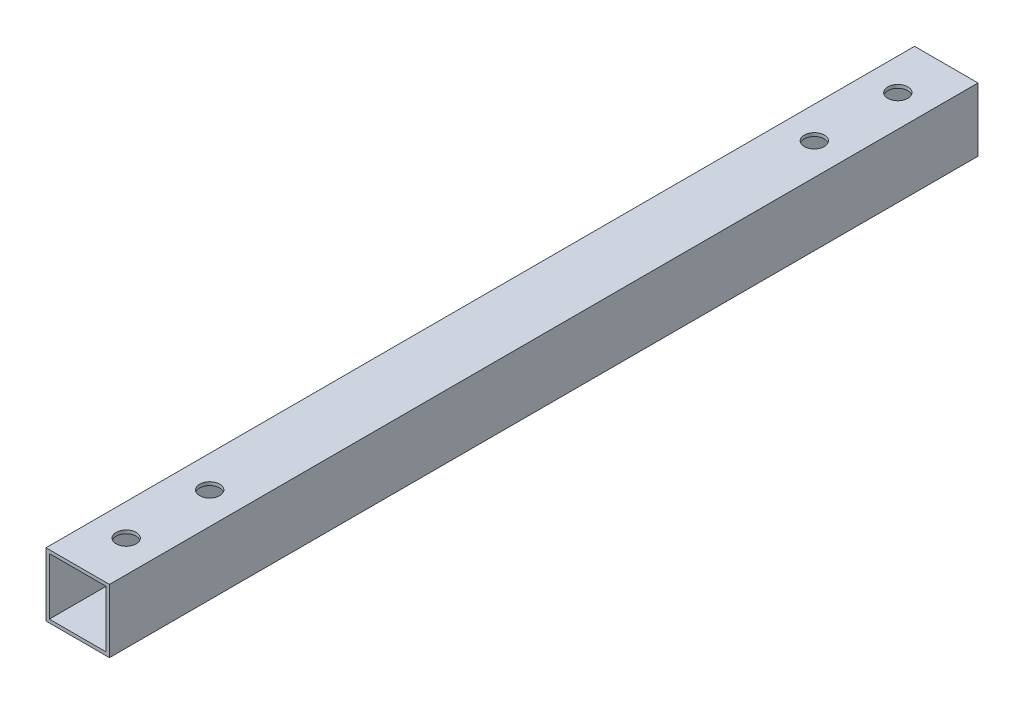
ISO-10303-21;
HEADER;
FILE_DESCRIPTION(('STEP AP214'),'2;1');
FILE_NAME('part.step','',(''),(''),'','','');
FILE_SCHEMA(('AUTOMOTIVE_DESIGN { 1 0 10303 214 1 1 1 1 }'));
ENDSEC;
DATA;
#1=APPLICATION_CONTEXT('core data for automotive mechanical design processes');
#2=APPLICATION_PROTOCOL_DEFINITION('international standard','automotive_design',2000,#1);
#3=PRODUCT_CONTEXT('',#1,'mechanical');
#4=PRODUCT('Part','Part','',(#3));
#5=PRODUCT_RELATED_PRODUCT_CATEGORY('part','',(#4));
#6=PRODUCT_DEFINITION_FORMATION('','',#4);
#7=PRODUCT_DEFINITION_CONTEXT('part definition',#1,'design');
#8=PRODUCT_DEFINITION('design','',#6,#7);
#9=PRODUCT_DEFINITION_SHAPE('','',#8);
#10=(LENGTH_UNIT() NAMED_UNIT(*) SI_UNIT(.MILLI.,.METRE.));
#11=(NAMED_UNIT(*) PLANE_ANGLE_UNIT() SI_UNIT($,.RADIAN.));
#12=(NAMED_UNIT(*) SI_UNIT($,.STERADIAN.) SOLID_ANGLE_UNIT());
#13=UNCERTAINTY_MEASURE_WITH_UNIT(LENGTH_MEASURE(1.E-05),#10,'distance_accuracy_value','');
#14=(GEOMETRIC_REPRESENTATION_CONTEXT(3) GLOBAL_UNCERTAINTY_ASSIGNED_CONTEXT((#13)) GLOBAL_UNIT_ASSIGNED_CONTEXT((#10,
#11,#12)) REPRESENTATION_CONTEXT('',''));
#15=CARTESIAN_POINT('',(0.,0.,0.));
#16=DIRECTION('',(0.,0.,1.));
#17=DIRECTION('',(1.,0.,0.));
#18=AXIS2_PLACEMENT_3D('',#15,#16,#17);
#19=CARTESIAN_POINT('',(9.5,9.5,260.));
#20=DIRECTION('',(-1.,0.,0.));
#21=DIRECTION('',(0.,0.,1.));
#22=AXIS2_PLACEMENT_3D('',#19,#20,#21);
#23=PLANE('',#22);
#24=DIRECTION('',(0.,1.,0.));
#25=VECTOR('',#24,1.);
#26=CARTESIAN_POINT('',(9.5,9.5,0.));
#27=LINE('',#26,#25);
#28=CARTESIAN_POINT('',(9.5,-9.5,0.));
#29=VERTEX_POINT('',#28);
#30=CARTESIAN_POINT('',(9.5,9.5,0.));
#31=VERTEX_POINT('',#30);
#32=EDGE_CURVE('E143',#29,#31,#27,.T.);
#33=ORIENTED_EDGE('',*,*,#32,.T.);
#34=DIRECTION('',(0.,0.,-1.));
#35=VECTOR('',#34,1.);
#36=CARTESIAN_POINT('',(9.5,9.5,260.));
#37=LINE('',#36,#35);
#38=CARTESIAN_POINT('',(9.5,9.5,260.));
#39=VERTEX_POINT('',#38);
#40=EDGE_CURVE('E11',#39,#31,#37,.T.);
#41=ORIENTED_EDGE('',*,*,#40,.F.);
#42=DIRECTION('',(0.,1.,0.));
#43=VECTOR('',#42,1.);
#44=CARTESIAN_POINT('',(9.5,9.5,260.));
#45=LINE('',#44,#43);
#46=CARTESIAN_POINT('',(9.5,-9.5,260.));
#47=VERTEX_POINT('',#46);
#48=EDGE_CURVE('E132',#47,#39,#45,.T.);
#49=ORIENTED_EDGE('',*,*,#48,.F.);
#50=DIRECTION('',(0.,0.,-1.));
#51=VECTOR('',#50,1.);
#52=CARTESIAN_POINT('',(9.5,-9.5,260.));
#53=LINE('',#52,#51);
#54=EDGE_CURVE('E142',#47,#29,#53,.T.);
#55=ORIENTED_EDGE('',*,*,#54,.T.);
#56=EDGE_LOOP('',(#33,#41,#49,#55));
#57=FACE_BOUND('',#56,.T.);
#58=ADVANCED_FACE('F32',(#57),#23,.F.);
#59=CARTESIAN_POINT('',(-9.5,9.5,260.));
#60=DIRECTION('',(0.,-1.,0.));
#61=DIRECTION('',(0.,0.,-1.));
#62=AXIS2_PLACEMENT_3D('',#59,#60,#61);
#63=PLANE('',#62);
#64=CARTESIAN_POINT('',(0.,9.5,245.5));
#65=DIRECTION('',(0.,1.,0.));
#66=DIRECTION('',(0.,0.,1.));
#67=AXIS2_PLACEMENT_3D('',#64,#65,#66);
#68=CIRCLE('',#67,2.99999999999989);
#69=CARTESIAN_POINT('',(0.,9.5,248.5));
#70=VERTEX_POINT('',#69);
#71=EDGE_CURVE('E270',#70,#70,#68,.T.);
#72=ORIENTED_EDGE('',*,*,#71,.F.);
#73=EDGE_LOOP('',(#72));
#74=FACE_BOUND('',#73,.T.);
#75=CARTESIAN_POINT('',(0.,9.5,14.5));
#76=DIRECTION('',(0.,1.,0.));
#77=DIRECTION('',(0.,0.,1.));
#78=AXIS2_PLACEMENT_3D('',#75,#76,#77);
#79=CIRCLE('',#78,2.99999999999989);
#80=CARTESIAN_POINT('',(0.,9.5,17.4999999999999));
#81=VERTEX_POINT('',#80);
#82=EDGE_CURVE('E263',#81,#81,#79,.T.);
#83=ORIENTED_EDGE('',*,*,#82,.F.);
#84=EDGE_LOOP('',(#83));
#85=FACE_BOUND('',#84,.T.);
#86=CARTESIAN_POINT('',(-1.5482407023093E-13,9.5,39.5));
#87=DIRECTION('',(0.,1.,0.));
#88=DIRECTION('',(0.,0.,1.));
#89=AXIS2_PLACEMENT_3D('',#86,#87,#88);
#90=CIRCLE('',#89,2.99999999999999);
#91=CARTESIAN_POINT('',(-1.5482407023093E-13,9.5,42.5));
#92=VERTEX_POINT('',#91);
#93=EDGE_CURVE('E275',#92,#92,#90,.T.);
#94=ORIENTED_EDGE('',*,*,#93,.F.);
#95=EDGE_LOOP('',(#94));
#96=FACE_BOUND('',#95,.T.);
#97=CARTESIAN_POINT('',(-1.5482407023093E-13,9.5,220.5));
#98=DIRECTION('',(0.,1.,0.));
#99=DIRECTION('',(0.,0.,1.));
#100=AXIS2_PLACEMENT_3D('',#97,#98,#99);
#101=CIRCLE('',#100,2.99999999999999);
#102=CARTESIAN_POINT('',(-1.5482407023093E-13,9.5,223.5));
#103=VERTEX_POINT('',#102);
#104=EDGE_CURVE('E258',#103,#103,#101,.T.);
#105=ORIENTED_EDGE('',*,*,#104,.F.);
#106=EDGE_LOOP('',(#105));
#107=FACE_BOUND('',#106,.T.);
#108=DIRECTION('',(-1.,0.,0.));
#109=VECTOR('',#108,1.);
#110=CARTESIAN_POINT('',(-9.5,9.5,0.));
#111=LINE('',#110,#109);
#112=CARTESIAN_POINT('',(-9.5,9.5,0.));
#113=VERTEX_POINT('',#112);
#114=EDGE_CURVE('E146',#31,#113,#111,.T.);
#115=ORIENTED_EDGE('',*,*,#114,.T.);
#116=DIRECTION('',(0.,0.,-1.));
#117=VECTOR('',#116,1.);
#118=CARTESIAN_POINT('',(-9.5,9.5,260.));
#119=LINE('',#118,#117);
#120=CARTESIAN_POINT('',(-9.5,9.5,260.));
#121=VERTEX_POINT('',#120);
#122=EDGE_CURVE('E40',#121,#113,#119,.T.);
#123=ORIENTED_EDGE('',*,*,#122,.F.);
#124=DIRECTION('',(-1.,0.,0.));
#125=VECTOR('',#124,1.);
#126=CARTESIAN_POINT('',(-9.5,9.5,260.));
#127=LINE('',#126,#125);
#128=EDGE_CURVE('E135',#39,#121,#127,.T.);
#129=ORIENTED_EDGE('',*,*,#128,.F.);
#130=ORIENTED_EDGE('',*,*,#40,.T.);
#131=EDGE_LOOP('',(#115,#123,#129,#130));
#132=FACE_BOUND('',#131,.T.);
#133=ADVANCED_FACE('F204',(#74,#85,#96,#107,#132),#63,.F.);
#134=CARTESIAN_POINT('',(-9.5,9.5,260.));
#135=DIRECTION('',(1.,0.,0.));
#136=DIRECTION('',(0.,1.,0.));
#137=AXIS2_PLACEMENT_3D('',#134,#135,#136);
#138=PLANE('',#137);
#139=DIRECTION('',(0.,-1.,0.));
#140=VECTOR('',#139,1.);
#141=CARTESIAN_POINT('',(-9.5,9.5,0.));
#142=LINE('',#141,#140);
#143=CARTESIAN_POINT('',(-9.5,-9.5,0.));
#144=VERTEX_POINT('',#143);
#145=EDGE_CURVE('E148',#113,#144,#142,.T.);
#146=ORIENTED_EDGE('',*,*,#145,.T.);
#147=DIRECTION('',(0.,0.,-1.));
#148=VECTOR('',#147,1.);
#149=CARTESIAN_POINT('',(-9.5,-9.5,260.));
#150=LINE('',#149,#148);
#151=CARTESIAN_POINT('',(-9.5,-9.5,260.));
#152=VERTEX_POINT('',#151);
#153=EDGE_CURVE('E153',#152,#144,#150,.T.);
#154=ORIENTED_EDGE('',*,*,#153,.F.);
#155=DIRECTION('',(0.,-1.,0.));
#156=VECTOR('',#155,1.);
#157=CARTESIAN_POINT('',(-9.5,9.5,260.));
#158=LINE('',#157,#156);
#159=EDGE_CURVE('E138',#121,#152,#158,.T.);
#160=ORIENTED_EDGE('',*,*,#159,.F.);
#161=ORIENTED_EDGE('',*,*,#122,.T.);
#162=EDGE_LOOP('',(#146,#154,#160,#161));
#163=FACE_BOUND('',#162,.T.);
#164=ADVANCED_FACE('F209',(#163),#138,.F.);
#165=CARTESIAN_POINT('',(-9.5,-9.5,260.));
#166=DIRECTION('',(0.,1.,0.));
#167=DIRECTION('',(-1.,0.,0.));
#168=AXIS2_PLACEMENT_3D('',#165,#166,#167);
#169=PLANE('',#168);
#170=CARTESIAN_POINT('',(0.,-9.5,245.5));
#171=DIRECTION('',(0.,1.,0.));
#172=DIRECTION('',(0.,0.,1.));
#173=AXIS2_PLACEMENT_3D('',#170,#171,#172);
#174=CIRCLE('',#173,2.99999999999989);
#175=CARTESIAN_POINT('',(0.,-9.5,248.5));
#176=VERTEX_POINT('',#175);
#177=EDGE_CURVE('E261',#176,#176,#174,.T.);
#178=ORIENTED_EDGE('',*,*,#177,.T.);
#179=EDGE_LOOP('',(#178));
#180=FACE_BOUND('',#179,.T.);
#181=CARTESIAN_POINT('',(0.,-9.5,14.5));
#182=DIRECTION('',(0.,1.,0.));
#183=DIRECTION('',(0.,0.,1.));
#184=AXIS2_PLACEMENT_3D('',#181,#182,#183);
#185=CIRCLE('',#184,2.99999999999989);
#186=CARTESIAN_POINT('',(0.,-9.5,17.4999999999999));
#187=VERTEX_POINT('',#186);
#188=EDGE_CURVE('E266',#187,#187,#185,.T.);
#189=ORIENTED_EDGE('',*,*,#188,.T.);
#190=EDGE_LOOP('',(#189));
#191=FACE_BOUND('',#190,.T.);
#192=CARTESIAN_POINT('',(-1.5482407023093E-13,-9.5,39.5));
#193=DIRECTION('',(0.,1.,0.));
#194=DIRECTION('',(0.,0.,1.));
#195=AXIS2_PLACEMENT_3D('',#192,#193,#194);
#196=CIRCLE('',#195,2.99999999999999);
#197=CARTESIAN_POINT('',(-1.5482407023093E-13,-9.5,42.5));
#198=VERTEX_POINT('',#197);
#199=EDGE_CURVE('E267',#198,#198,#196,.T.);
#200=ORIENTED_EDGE('',*,*,#199,.T.);
#201=EDGE_LOOP('',(#200));
#202=FACE_BOUND('',#201,.T.);
#203=CARTESIAN_POINT('',(-1.5482407023093E-13,-9.5,220.5));
#204=DIRECTION('',(0.,1.,0.));
#205=DIRECTION('',(0.,0.,1.));
#206=AXIS2_PLACEMENT_3D('',#203,#204,#205);
#207=CIRCLE('',#206,2.99999999999999);
#208=CARTESIAN_POINT('',(-1.5482407023093E-13,-9.5,223.5));
#209=VERTEX_POINT('',#208);
#210=EDGE_CURVE('E162',#209,#209,#207,.T.);
#211=ORIENTED_EDGE('',*,*,#210,.T.);
#212=EDGE_LOOP('',(#211));
#213=FACE_BOUND('',#212,.T.);
#214=DIRECTION('',(1.,0.,0.));
#215=VECTOR('',#214,1.);
#216=CARTESIAN_POINT('',(-9.5,-9.5,0.));
#217=LINE('',#216,#215);
#218=EDGE_CURVE('E136',#144,#29,#217,.T.);
#219=ORIENTED_EDGE('',*,*,#218,.T.);
#220=ORIENTED_EDGE('',*,*,#54,.F.);
#221=DIRECTION('',(1.,0.,0.));
#222=VECTOR('',#221,1.);
#223=CARTESIAN_POINT('',(-9.5,-9.5,260.));
#224=LINE('',#223,#222);
#225=EDGE_CURVE('E140',#152,#47,#224,.T.);
#226=ORIENTED_EDGE('',*,*,#225,.F.);
#227=ORIENTED_EDGE('',*,*,#153,.T.);
#228=EDGE_LOOP('',(#219,#220,#226,#227));
#229=FACE_BOUND('',#228,.T.);
#230=ADVANCED_FACE('F223',(#180,#191,#202,#213,#229),#169,.F.);
#231=CARTESIAN_POINT('',(0.,0.,260.));
#232=DIRECTION('',(0.,0.,1.));
#233=DIRECTION('',(1.,0.,0.));
#234=AXIS2_PLACEMENT_3D('',#231,#232,#233);
#235=PLANE('',#234);
#236=DIRECTION('',(0.,1.,0.));
#237=VECTOR('',#236,1.);
#238=CARTESIAN_POINT('',(8.5,9.5,260.));
#239=LINE('',#238,#237);
#240=CARTESIAN_POINT('',(8.5,-8.5,260.));
#241=VERTEX_POINT('',#240);
#242=CARTESIAN_POINT('',(8.5,8.5,260.));
#243=VERTEX_POINT('',#242);
#244=EDGE_CURVE('E120',#241,#243,#239,.T.);
#245=ORIENTED_EDGE('',*,*,#244,.F.);
#246=DIRECTION('',(1.,0.,0.));
#247=VECTOR('',#246,1.);
#248=CARTESIAN_POINT('',(-9.5,-8.5,260.));
#249=LINE('',#248,#247);
#250=CARTESIAN_POINT('',(-8.5,-8.5,260.));
#251=VERTEX_POINT('',#250);
#252=EDGE_CURVE('E103',#251,#241,#249,.T.);
#253=ORIENTED_EDGE('',*,*,#252,.F.);
#254=DIRECTION('',(0.,-1.,0.));
#255=VECTOR('',#254,1.);
#256=CARTESIAN_POINT('',(-8.5,9.5,260.));
#257=LINE('',#256,#255);
#258=CARTESIAN_POINT('',(-8.5,8.5,260.));
#259=VERTEX_POINT('',#258);
#260=EDGE_CURVE('E129',#259,#251,#257,.T.);
#261=ORIENTED_EDGE('',*,*,#260,.F.);
#262=DIRECTION('',(-1.,0.,0.));
#263=VECTOR('',#262,1.);
#264=CARTESIAN_POINT('',(-9.5,8.5,260.));
#265=LINE('',#264,#263);
#266=EDGE_CURVE('E122',#243,#259,#265,.T.);
#267=ORIENTED_EDGE('',*,*,#266,.F.);
#268=EDGE_LOOP('',(#245,#253,#261,#267));
#269=FACE_BOUND('',#268,.T.);
#270=ORIENTED_EDGE('',*,*,#48,.T.);
#271=ORIENTED_EDGE('',*,*,#128,.T.);
#272=ORIENTED_EDGE('',*,*,#159,.T.);
#273=ORIENTED_EDGE('',*,*,#225,.T.);
#274=EDGE_LOOP('',(#270,#271,#272,#273));
#275=FACE_BOUND('',#274,.T.);
#276=ADVANCED_FACE('F188',(#269,#275),#235,.T.);
#277=CARTESIAN_POINT('',(0.,0.,0.));
#278=DIRECTION('',(0.,0.,1.));
#279=DIRECTION('',(1.,0.,0.));
#280=AXIS2_PLACEMENT_3D('',#277,#278,#279);
#281=PLANE('',#280);
#282=DIRECTION('',(1.,0.,0.));
#283=VECTOR('',#282,1.);
#284=CARTESIAN_POINT('',(-9.5,-8.5,0.));
#285=LINE('',#284,#283);
#286=CARTESIAN_POINT('',(-8.5,-8.5,0.));
#287=VERTEX_POINT('',#286);
#288=CARTESIAN_POINT('',(8.5,-8.5,0.));
#289=VERTEX_POINT('',#288);
#290=EDGE_CURVE('E101',#287,#289,#285,.T.);
#291=ORIENTED_EDGE('',*,*,#290,.T.);
#292=DIRECTION('',(0.,1.,0.));
#293=VECTOR('',#292,1.);
#294=CARTESIAN_POINT('',(8.5,9.5,0.));
#295=LINE('',#294,#293);
#296=CARTESIAN_POINT('',(8.5,8.5,0.));
#297=VERTEX_POINT('',#296);
#298=EDGE_CURVE('E109',#289,#297,#295,.T.);
#299=ORIENTED_EDGE('',*,*,#298,.T.);
#300=DIRECTION('',(-1.,0.,0.));
#301=VECTOR('',#300,1.);
#302=CARTESIAN_POINT('',(-9.5,8.5,0.));
#303=LINE('',#302,#301);
#304=CARTESIAN_POINT('',(-8.5,8.5,0.));
#305=VERTEX_POINT('',#304);
#306=EDGE_CURVE('E115',#297,#305,#303,.T.);
#307=ORIENTED_EDGE('',*,*,#306,.T.);
#308=DIRECTION('',(0.,-1.,0.));
#309=VECTOR('',#308,1.);
#310=CARTESIAN_POINT('',(-8.5,9.5,0.));
#311=LINE('',#310,#309);
#312=EDGE_CURVE('E55',#305,#287,#311,.T.);
#313=ORIENTED_EDGE('',*,*,#312,.T.);
#314=EDGE_LOOP('',(#291,#299,#307,#313));
#315=FACE_BOUND('',#314,.T.);
#316=ORIENTED_EDGE('',*,*,#32,.F.);
#317=ORIENTED_EDGE('',*,*,#218,.F.);
#318=ORIENTED_EDGE('',*,*,#145,.F.);
#319=ORIENTED_EDGE('',*,*,#114,.F.);
#320=EDGE_LOOP('',(#316,#317,#318,#319));
#321=FACE_BOUND('',#320,.T.);
#322=ADVANCED_FACE('F118',(#315,#321),#281,.F.);
#323=CARTESIAN_POINT('',(8.5,9.5,260.));
#324=DIRECTION('',(-1.,0.,0.));
#325=DIRECTION('',(0.,0.,1.));
#326=AXIS2_PLACEMENT_3D('',#323,#324,#325);
#327=PLANE('',#326);
#328=ORIENTED_EDGE('',*,*,#298,.F.);
#329=DIRECTION('',(0.,0.,-1.));
#330=VECTOR('',#329,1.);
#331=CARTESIAN_POINT('',(8.5,-8.49999999999999,260.));
#332=LINE('',#331,#330);
#333=EDGE_CURVE('E97',#241,#289,#332,.T.);
#334=ORIENTED_EDGE('',*,*,#333,.F.);
#335=ORIENTED_EDGE('',*,*,#244,.T.);
#336=DIRECTION('',(0.,0.,-1.));
#337=VECTOR('',#336,1.);
#338=CARTESIAN_POINT('',(8.5,8.5,260.));
#339=LINE('',#338,#337);
#340=EDGE_CURVE('E112',#243,#297,#339,.T.);
#341=ORIENTED_EDGE('',*,*,#340,.T.);
#342=EDGE_LOOP('',(#328,#334,#335,#341));
#343=FACE_BOUND('',#342,.T.);
#344=ADVANCED_FACE('F110',(#343),#327,.T.);
#345=CARTESIAN_POINT('',(-9.5,8.5,260.));
#346=DIRECTION('',(0.,-1.,0.));
#347=DIRECTION('',(0.,0.,-1.));
#348=AXIS2_PLACEMENT_3D('',#345,#346,#347);
#349=PLANE('',#348);
#350=CARTESIAN_POINT('',(0.,8.5,245.5));
#351=DIRECTION('',(0.,-1.,0.));
#352=DIRECTION('',(0.,0.,-1.));
#353=AXIS2_PLACEMENT_3D('',#350,#351,#352);
#354=CIRCLE('',#353,2.99999999999989);
#355=CARTESIAN_POINT('',(0.,8.5,242.5));
#356=VERTEX_POINT('',#355);
#357=EDGE_CURVE('E116',#356,#356,#354,.T.);
#358=ORIENTED_EDGE('',*,*,#357,.F.);
#359=EDGE_LOOP('',(#358));
#360=FACE_BOUND('',#359,.T.);
#361=CARTESIAN_POINT('',(0.,8.5,14.5));
#362=DIRECTION('',(0.,-1.,0.));
#363=DIRECTION('',(0.,0.,-1.));
#364=AXIS2_PLACEMENT_3D('',#361,#362,#363);
#365=CIRCLE('',#364,2.99999999999989);
#366=CARTESIAN_POINT('',(0.,8.5,11.5000000000001));
#367=VERTEX_POINT('',#366);
#368=EDGE_CURVE('E168',#367,#367,#365,.T.);
#369=ORIENTED_EDGE('',*,*,#368,.F.);
#370=EDGE_LOOP('',(#369));
#371=FACE_BOUND('',#370,.T.);
#372=CARTESIAN_POINT('',(-1.5482407023093E-13,8.5,39.5));
#373=DIRECTION('',(0.,-1.,0.));
#374=DIRECTION('',(0.,0.,-1.));
#375=AXIS2_PLACEMENT_3D('',#372,#373,#374);
#376=CIRCLE('',#375,2.99999999999999);
#377=CARTESIAN_POINT('',(-1.5482407023093E-13,8.5,36.5));
#378=VERTEX_POINT('',#377);
#379=EDGE_CURVE('E165',#378,#378,#376,.T.);
#380=ORIENTED_EDGE('',*,*,#379,.F.);
#381=EDGE_LOOP('',(#380));
#382=FACE_BOUND('',#381,.T.);
#383=CARTESIAN_POINT('',(-1.5482407023093E-13,8.5,220.5));
#384=DIRECTION('',(0.,-1.,0.));
#385=DIRECTION('',(0.,0.,-1.));
#386=AXIS2_PLACEMENT_3D('',#383,#384,#385);
#387=CIRCLE('',#386,2.99999999999999);
#388=CARTESIAN_POINT('',(-1.5482407023093E-13,8.5,217.5));
#389=VERTEX_POINT('',#388);
#390=EDGE_CURVE('E161',#389,#389,#387,.T.);
#391=ORIENTED_EDGE('',*,*,#390,.F.);
#392=EDGE_LOOP('',(#391));
#393=FACE_BOUND('',#392,.T.);
#394=ORIENTED_EDGE('',*,*,#306,.F.);
#395=ORIENTED_EDGE('',*,*,#340,.F.);
#396=ORIENTED_EDGE('',*,*,#266,.T.);
#397=DIRECTION('',(0.,0.,-1.));
#398=VECTOR('',#397,1.);
#399=CARTESIAN_POINT('',(-8.5,8.5,260.));
#400=LINE('',#399,#398);
#401=EDGE_CURVE('E182',#259,#305,#400,.T.);
#402=ORIENTED_EDGE('',*,*,#401,.T.);
#403=EDGE_LOOP('',(#394,#395,#396,#402));
#404=FACE_BOUND('',#403,.T.);
#405=ADVANCED_FACE('F191',(#360,#371,#382,#393,#404),#349,.T.);
#406=CARTESIAN_POINT('',(-8.5,9.5,260.));
#407=DIRECTION('',(1.,0.,0.));
#408=DIRECTION('',(0.,1.,0.));
#409=AXIS2_PLACEMENT_3D('',#406,#407,#408);
#410=PLANE('',#409);
#411=ORIENTED_EDGE('',*,*,#312,.F.);
#412=ORIENTED_EDGE('',*,*,#401,.F.);
#413=ORIENTED_EDGE('',*,*,#260,.T.);
#414=DIRECTION('',(0.,0.,-1.));
#415=VECTOR('',#414,1.);
#416=CARTESIAN_POINT('',(-8.5,-8.5,260.));
#417=LINE('',#416,#415);
#418=EDGE_CURVE('E48',#251,#287,#417,.T.);
#419=ORIENTED_EDGE('',*,*,#418,.T.);
#420=EDGE_LOOP('',(#411,#412,#413,#419));
#421=FACE_BOUND('',#420,.T.);
#422=ADVANCED_FACE('F184',(#421),#410,.T.);
#423=CARTESIAN_POINT('',(-9.5,-8.5,260.));
#424=DIRECTION('',(0.,1.,0.));
#425=DIRECTION('',(-1.,0.,0.));
#426=AXIS2_PLACEMENT_3D('',#423,#424,#425);
#427=PLANE('',#426);
#428=CARTESIAN_POINT('',(0.,-8.5,245.5));
#429=DIRECTION('',(0.,1.,0.));
#430=DIRECTION('',(-1.,0.,0.));
#431=AXIS2_PLACEMENT_3D('',#428,#429,#430);
#432=CIRCLE('',#431,2.99999999999989);
#433=CARTESIAN_POINT('',(-2.99999999999982,-8.5,245.5));
#434=VERTEX_POINT('',#433);
#435=EDGE_CURVE('E35',#434,#434,#432,.T.);
#436=ORIENTED_EDGE('',*,*,#435,.F.);
#437=EDGE_LOOP('',(#436));
#438=FACE_BOUND('',#437,.T.);
#439=CARTESIAN_POINT('',(0.,-8.5,14.5));
#440=DIRECTION('',(0.,1.,0.));
#441=DIRECTION('',(-1.,0.,0.));
#442=AXIS2_PLACEMENT_3D('',#439,#440,#441);
#443=CIRCLE('',#442,2.99999999999989);
#444=CARTESIAN_POINT('',(-2.99999999999981,-8.5,14.5));
#445=VERTEX_POINT('',#444);
#446=EDGE_CURVE('E166',#445,#445,#443,.T.);
#447=ORIENTED_EDGE('',*,*,#446,.F.);
#448=EDGE_LOOP('',(#447));
#449=FACE_BOUND('',#448,.T.);
#450=CARTESIAN_POINT('',(-1.5482407023093E-13,-8.5,39.5));
#451=DIRECTION('',(0.,1.,0.));
#452=DIRECTION('',(-1.,0.,0.));
#453=AXIS2_PLACEMENT_3D('',#450,#451,#452);
#454=CIRCLE('',#453,2.99999999999999);
#455=CARTESIAN_POINT('',(-3.00000000000014,-8.5,39.5));
#456=VERTEX_POINT('',#455);
#457=EDGE_CURVE('E163',#456,#456,#454,.T.);
#458=ORIENTED_EDGE('',*,*,#457,.F.);
#459=EDGE_LOOP('',(#458));
#460=FACE_BOUND('',#459,.T.);
#461=CARTESIAN_POINT('',(-1.5482407023093E-13,-8.5,220.5));
#462=DIRECTION('',(0.,1.,0.));
#463=DIRECTION('',(-1.,0.,0.));
#464=AXIS2_PLACEMENT_3D('',#461,#462,#463);
#465=CIRCLE('',#464,2.99999999999999);
#466=CARTESIAN_POINT('',(-3.00000000000014,-8.5,220.5));
#467=VERTEX_POINT('',#466);
#468=EDGE_CURVE('E158',#467,#467,#465,.T.);
#469=ORIENTED_EDGE('',*,*,#468,.F.);
#470=EDGE_LOOP('',(#469));
#471=FACE_BOUND('',#470,.T.);
#472=ORIENTED_EDGE('',*,*,#290,.F.);
#473=ORIENTED_EDGE('',*,*,#418,.F.);
#474=ORIENTED_EDGE('',*,*,#252,.T.);
#475=ORIENTED_EDGE('',*,*,#333,.T.);
#476=EDGE_LOOP('',(#472,#473,#474,#475));
#477=FACE_BOUND('',#476,.T.);
#478=ADVANCED_FACE('F99',(#438,#449,#460,#471,#477),#427,.T.);
#479=CARTESIAN_POINT('',(-1.5482407023093E-13,-9.5,220.5));
#480=DIRECTION('',(0.,1.,0.));
#481=DIRECTION('',(0.,0.,1.));
#482=AXIS2_PLACEMENT_3D('',#479,#480,#481);
#483=CYLINDRICAL_SURFACE('',#482,2.99999999999999);
#484=ORIENTED_EDGE('',*,*,#468,.T.);
#485=EDGE_LOOP('',(#484));
#486=FACE_BOUND('',#485,.T.);
#487=ORIENTED_EDGE('',*,*,#210,.F.);
#488=EDGE_LOOP('',(#487));
#489=FACE_BOUND('',#488,.T.);
#490=ADVANCED_FACE('F238',(#486,#489),#483,.F.);
#491=CARTESIAN_POINT('',(-1.5482407023093E-13,-9.5,39.5));
#492=DIRECTION('',(0.,1.,0.));
#493=DIRECTION('',(0.,0.,1.));
#494=AXIS2_PLACEMENT_3D('',#491,#492,#493);
#495=CYLINDRICAL_SURFACE('',#494,2.99999999999999);
#496=ORIENTED_EDGE('',*,*,#457,.T.);
#497=EDGE_LOOP('',(#496));
#498=FACE_BOUND('',#497,.T.);
#499=ORIENTED_EDGE('',*,*,#199,.F.);
#500=EDGE_LOOP('',(#499));
#501=FACE_BOUND('',#500,.T.);
#502=ADVANCED_FACE('F243',(#498,#501),#495,.F.);
#503=CARTESIAN_POINT('',(0.,-9.5,14.5));
#504=DIRECTION('',(0.,1.,0.));
#505=DIRECTION('',(0.,0.,1.));
#506=AXIS2_PLACEMENT_3D('',#503,#504,#505);
#507=CYLINDRICAL_SURFACE('',#506,2.99999999999989);
#508=ORIENTED_EDGE('',*,*,#446,.T.);
#509=EDGE_LOOP('',(#508));
#510=FACE_BOUND('',#509,.T.);
#511=ORIENTED_EDGE('',*,*,#188,.F.);
#512=EDGE_LOOP('',(#511));
#513=FACE_BOUND('',#512,.T.);
#514=ADVANCED_FACE('F283',(#510,#513),#507,.F.);
#515=CARTESIAN_POINT('',(0.,-9.5,245.5));
#516=DIRECTION('',(0.,1.,0.));
#517=DIRECTION('',(0.,0.,1.));
#518=AXIS2_PLACEMENT_3D('',#515,#516,#517);
#519=CYLINDRICAL_SURFACE('',#518,2.99999999999989);
#520=ORIENTED_EDGE('',*,*,#435,.T.);
#521=EDGE_LOOP('',(#520));
#522=FACE_BOUND('',#521,.T.);
#523=ORIENTED_EDGE('',*,*,#177,.F.);
#524=EDGE_LOOP('',(#523));
#525=FACE_BOUND('',#524,.T.);
#526=ADVANCED_FACE('F290',(#522,#525),#519,.F.);
#527=ORIENTED_EDGE('',*,*,#390,.T.);
#528=EDGE_LOOP('',(#527));
#529=FACE_BOUND('',#528,.T.);
#530=ORIENTED_EDGE('',*,*,#104,.T.);
#531=EDGE_LOOP('',(#530));
#532=FACE_BOUND('',#531,.T.);
#533=ADVANCED_FACE('F246',(#529,#532),#483,.F.);
#534=ORIENTED_EDGE('',*,*,#379,.T.);
#535=EDGE_LOOP('',(#534));
#536=FACE_BOUND('',#535,.T.);
#537=ORIENTED_EDGE('',*,*,#93,.T.);
#538=EDGE_LOOP('',(#537));
#539=FACE_BOUND('',#538,.T.);
#540=ADVANCED_FACE('F286',(#536,#539),#495,.F.);
#541=ORIENTED_EDGE('',*,*,#368,.T.);
#542=EDGE_LOOP('',(#541));
#543=FACE_BOUND('',#542,.T.);
#544=ORIENTED_EDGE('',*,*,#82,.T.);
#545=EDGE_LOOP('',(#544));
#546=FACE_BOUND('',#545,.T.);
#547=ADVANCED_FACE('F292',(#543,#546),#507,.F.);
#548=ORIENTED_EDGE('',*,*,#357,.T.);
#549=EDGE_LOOP('',(#548));
#550=FACE_BOUND('',#549,.T.);
#551=ORIENTED_EDGE('',*,*,#71,.T.);
#552=EDGE_LOOP('',(#551));
#553=FACE_BOUND('',#552,.T.);
#554=ADVANCED_FACE('F299',(#550,#553),#519,.F.);
#555=CLOSED_SHELL('',(#58,#133,#164,#230,#276,#322,#344,#405,#422,#478,#490,#502,#514,#526,#533,
#540,#547,#554));
#556=MANIFOLD_SOLID_BREP('B2',#555);
#557=ADVANCED_BREP_SHAPE_REPRESENTATION('',(#18,#556),#14);
#558=SHAPE_DEFINITION_REPRESENTATION(#9,#557);
ENDSEC;
END-ISO-10303-21;
